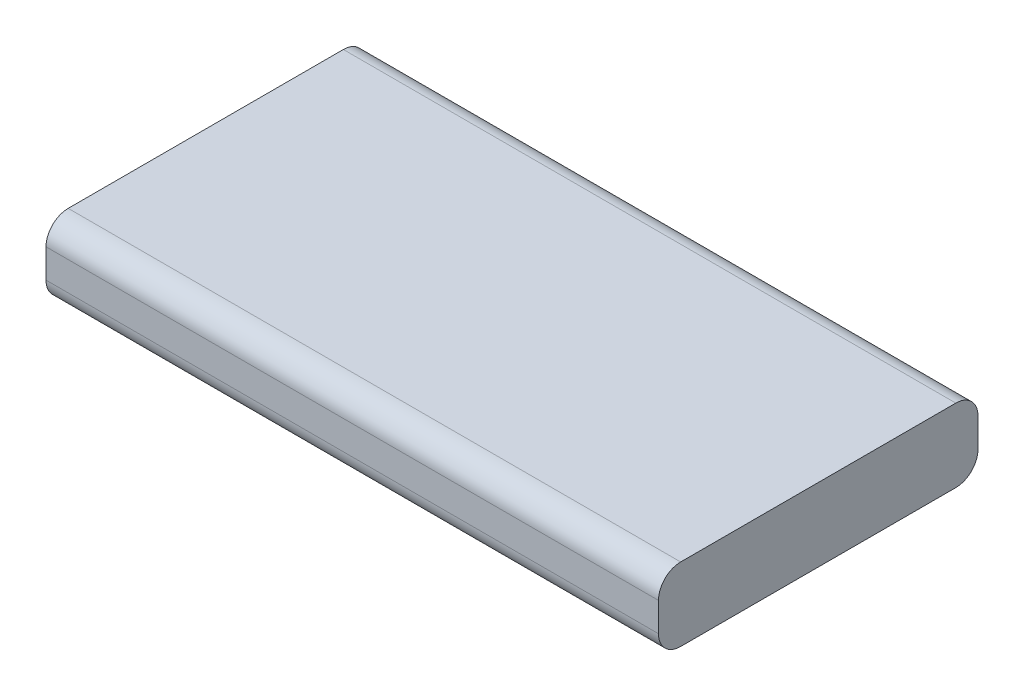
ISO-10303-21;
HEADER;
FILE_DESCRIPTION(('STEP AP214'),'2;1');
FILE_NAME('part.step','',(''),(''),'','','');
FILE_SCHEMA(('AUTOMOTIVE_DESIGN { 1 0 10303 214 1 1 1 1 }'));
ENDSEC;
DATA;
#1=APPLICATION_CONTEXT('core data for automotive mechanical design processes');
#2=APPLICATION_PROTOCOL_DEFINITION('international standard','automotive_design',2000,#1);
#3=PRODUCT_CONTEXT('',#1,'mechanical');
#4=PRODUCT('Part','Part','',(#3));
#5=PRODUCT_RELATED_PRODUCT_CATEGORY('part','',(#4));
#6=PRODUCT_DEFINITION_FORMATION('','',#4);
#7=PRODUCT_DEFINITION_CONTEXT('part definition',#1,'design');
#8=PRODUCT_DEFINITION('design','',#6,#7);
#9=PRODUCT_DEFINITION_SHAPE('','',#8);
#10=(LENGTH_UNIT() NAMED_UNIT(*) SI_UNIT(.MILLI.,.METRE.));
#11=(NAMED_UNIT(*) PLANE_ANGLE_UNIT() SI_UNIT($,.RADIAN.));
#12=(NAMED_UNIT(*) SI_UNIT($,.STERADIAN.) SOLID_ANGLE_UNIT());
#13=UNCERTAINTY_MEASURE_WITH_UNIT(LENGTH_MEASURE(1.E-05),#10,'distance_accuracy_value','');
#14=(GEOMETRIC_REPRESENTATION_CONTEXT(3) GLOBAL_UNCERTAINTY_ASSIGNED_CONTEXT((#13)) GLOBAL_UNIT_ASSIGNED_CONTEXT((#10,
#11,#12)) REPRESENTATION_CONTEXT('',''));
#15=CARTESIAN_POINT('',(0.,0.,0.));
#16=DIRECTION('',(0.,0.,1.));
#17=DIRECTION('',(1.,0.,0.));
#18=AXIS2_PLACEMENT_3D('',#15,#16,#17);
#19=CARTESIAN_POINT('',(13.8,-1.65,-7.2));
#20=DIRECTION('',(1.,0.,0.));
#21=DIRECTION('',(0.,0.,-1.));
#22=AXIS2_PLACEMENT_3D('',#19,#20,#21);
#23=PLANE('',#22);
#24=DIRECTION('',(0.,0.,-1.));
#25=VECTOR('',#24,1.);
#26=CARTESIAN_POINT('',(13.8,-1.65,-7.2));
#27=LINE('',#26,#25);
#28=CARTESIAN_POINT('',(13.8,-1.65,6.2));
#29=VERTEX_POINT('',#28);
#30=CARTESIAN_POINT('',(13.8,-1.65,-6.2));
#31=VERTEX_POINT('',#30);
#32=EDGE_CURVE('E171',#29,#31,#27,.T.);
#33=ORIENTED_EDGE('',*,*,#32,.T.);
#34=CARTESIAN_POINT('',(13.8,-0.65,-6.2));
#35=DIRECTION('',(1.,0.,0.));
#36=DIRECTION('',(0.,0.,-1.));
#37=AXIS2_PLACEMENT_3D('',#34,#35,#36);
#38=CIRCLE('',#37,1.);
#39=CARTESIAN_POINT('',(13.8,-0.65,-7.2));
#40=VERTEX_POINT('',#39);
#41=EDGE_CURVE('E146',#31,#40,#38,.T.);
#42=ORIENTED_EDGE('',*,*,#41,.T.);
#43=DIRECTION('',(0.,1.,0.));
#44=VECTOR('',#43,1.);
#45=CARTESIAN_POINT('',(13.8,-1.65,-7.2));
#46=LINE('',#45,#44);
#47=CARTESIAN_POINT('',(13.8,0.65,-7.2));
#48=VERTEX_POINT('',#47);
#49=EDGE_CURVE('E120',#40,#48,#46,.T.);
#50=ORIENTED_EDGE('',*,*,#49,.T.);
#51=CARTESIAN_POINT('',(13.8,0.65,-6.2));
#52=DIRECTION('',(1.,0.,0.));
#53=DIRECTION('',(0.,0.,-1.));
#54=AXIS2_PLACEMENT_3D('',#51,#52,#53);
#55=CIRCLE('',#54,1.);
#56=CARTESIAN_POINT('',(13.8,1.65,-6.2));
#57=VERTEX_POINT('',#56);
#58=EDGE_CURVE('E144',#48,#57,#55,.T.);
#59=ORIENTED_EDGE('',*,*,#58,.T.);
#60=DIRECTION('',(0.,0.,-1.));
#61=VECTOR('',#60,1.);
#62=CARTESIAN_POINT('',(13.8,1.65,-7.2));
#63=LINE('',#62,#61);
#64=CARTESIAN_POINT('',(13.8,1.65,6.2));
#65=VERTEX_POINT('',#64);
#66=EDGE_CURVE('E165',#65,#57,#63,.T.);
#67=ORIENTED_EDGE('',*,*,#66,.F.);
#68=CARTESIAN_POINT('',(13.8,0.65,6.2));
#69=DIRECTION('',(1.,0.,0.));
#70=DIRECTION('',(0.,0.,-1.));
#71=AXIS2_PLACEMENT_3D('',#68,#69,#70);
#72=CIRCLE('',#71,1.);
#73=CARTESIAN_POINT('',(13.8,0.65,7.2));
#74=VERTEX_POINT('',#73);
#75=EDGE_CURVE('E49',#65,#74,#72,.T.);
#76=ORIENTED_EDGE('',*,*,#75,.T.);
#77=DIRECTION('',(0.,1.,0.));
#78=VECTOR('',#77,1.);
#79=CARTESIAN_POINT('',(13.8,-1.65,7.2));
#80=LINE('',#79,#78);
#81=CARTESIAN_POINT('',(13.8,-0.65,7.2));
#82=VERTEX_POINT('',#81);
#83=EDGE_CURVE('E129',#82,#74,#80,.T.);
#84=ORIENTED_EDGE('',*,*,#83,.F.);
#85=CARTESIAN_POINT('',(13.8,-0.65,6.2));
#86=DIRECTION('',(1.,0.,0.));
#87=DIRECTION('',(0.,0.,-1.));
#88=AXIS2_PLACEMENT_3D('',#85,#86,#87);
#89=CIRCLE('',#88,1.);
#90=EDGE_CURVE('E57',#82,#29,#89,.T.);
#91=ORIENTED_EDGE('',*,*,#90,.T.);
#92=EDGE_LOOP('',(#33,#42,#50,#59,#67,#76,#84,#91));
#93=FACE_BOUND('',#92,.T.);
#94=ADVANCED_FACE('F34',(#93),#23,.T.);
#95=CARTESIAN_POINT('',(-13.8,-1.65,7.2));
#96=DIRECTION('',(0.,0.,1.));
#97=DIRECTION('',(1.,0.,0.));
#98=AXIS2_PLACEMENT_3D('',#95,#96,#97);
#99=PLANE('',#98);
#100=DIRECTION('',(0.,1.,0.));
#101=VECTOR('',#100,1.);
#102=CARTESIAN_POINT('',(-13.8,-1.65,7.2));
#103=LINE('',#102,#101);
#104=CARTESIAN_POINT('',(-13.8,-0.65,7.2));
#105=VERTEX_POINT('',#104);
#106=CARTESIAN_POINT('',(-13.8,0.65,7.2));
#107=VERTEX_POINT('',#106);
#108=EDGE_CURVE('E126',#105,#107,#103,.T.);
#109=ORIENTED_EDGE('',*,*,#108,.F.);
#110=DIRECTION('',(1.,0.,0.));
#111=VECTOR('',#110,1.);
#112=CARTESIAN_POINT('',(13.8,-0.65,7.2));
#113=LINE('',#112,#111);
#114=EDGE_CURVE('E11',#105,#82,#113,.T.);
#115=ORIENTED_EDGE('',*,*,#114,.T.);
#116=ORIENTED_EDGE('',*,*,#83,.T.);
#117=DIRECTION('',(1.,0.,0.));
#118=VECTOR('',#117,1.);
#119=CARTESIAN_POINT('',(-13.8,0.65,7.2));
#120=LINE('',#119,#118);
#121=EDGE_CURVE('E42',#74,#107,#120,.F.);
#122=ORIENTED_EDGE('',*,*,#121,.T.);
#123=EDGE_LOOP('',(#109,#115,#116,#122));
#124=FACE_BOUND('',#123,.T.);
#125=ADVANCED_FACE('F156',(#124),#99,.T.);
#126=CARTESIAN_POINT('',(-13.8,-1.65,-7.2));
#127=DIRECTION('',(-1.,0.,0.));
#128=DIRECTION('',(0.,0.,1.));
#129=AXIS2_PLACEMENT_3D('',#126,#127,#128);
#130=PLANE('',#129);
#131=DIRECTION('',(0.,1.,0.));
#132=VECTOR('',#131,1.);
#133=CARTESIAN_POINT('',(-13.8,-1.65,-7.2));
#134=LINE('',#133,#132);
#135=CARTESIAN_POINT('',(-13.8,-0.65,-7.2));
#136=VERTEX_POINT('',#135);
#137=CARTESIAN_POINT('',(-13.8,0.65,-7.2));
#138=VERTEX_POINT('',#137);
#139=EDGE_CURVE('E117',#136,#138,#134,.T.);
#140=ORIENTED_EDGE('',*,*,#139,.F.);
#141=CARTESIAN_POINT('',(-13.8,-0.65,-6.2));
#142=DIRECTION('',(-1.,0.,0.));
#143=DIRECTION('',(0.,0.,1.));
#144=AXIS2_PLACEMENT_3D('',#141,#142,#143);
#145=CIRCLE('',#144,1.);
#146=CARTESIAN_POINT('',(-13.8,-1.65,-6.2));
#147=VERTEX_POINT('',#146);
#148=EDGE_CURVE('E100',#136,#147,#145,.T.);
#149=ORIENTED_EDGE('',*,*,#148,.T.);
#150=DIRECTION('',(0.,0.,1.));
#151=VECTOR('',#150,1.);
#152=CARTESIAN_POINT('',(-13.8,-1.65,-7.2));
#153=LINE('',#152,#151);
#154=CARTESIAN_POINT('',(-13.8,-1.65,6.2));
#155=VERTEX_POINT('',#154);
#156=EDGE_CURVE('E131',#147,#155,#153,.T.);
#157=ORIENTED_EDGE('',*,*,#156,.T.);
#158=CARTESIAN_POINT('',(-13.8,-0.65,6.2));
#159=DIRECTION('',(-1.,0.,0.));
#160=DIRECTION('',(0.,0.,1.));
#161=AXIS2_PLACEMENT_3D('',#158,#159,#160);
#162=CIRCLE('',#161,1.);
#163=EDGE_CURVE('E137',#155,#105,#162,.T.);
#164=ORIENTED_EDGE('',*,*,#163,.T.);
#165=ORIENTED_EDGE('',*,*,#108,.T.);
#166=CARTESIAN_POINT('',(-13.8,0.65,6.2));
#167=DIRECTION('',(-1.,0.,0.));
#168=DIRECTION('',(0.,0.,1.));
#169=AXIS2_PLACEMENT_3D('',#166,#167,#168);
#170=CIRCLE('',#169,1.);
#171=CARTESIAN_POINT('',(-13.8,1.65,6.2));
#172=VERTEX_POINT('',#171);
#173=EDGE_CURVE('E121',#107,#172,#170,.T.);
#174=ORIENTED_EDGE('',*,*,#173,.T.);
#175=DIRECTION('',(0.,0.,1.));
#176=VECTOR('',#175,1.);
#177=CARTESIAN_POINT('',(-13.8,1.65,-7.2));
#178=LINE('',#177,#176);
#179=CARTESIAN_POINT('',(-13.8,1.65,-6.2));
#180=VERTEX_POINT('',#179);
#181=EDGE_CURVE('E167',#180,#172,#178,.T.);
#182=ORIENTED_EDGE('',*,*,#181,.F.);
#183=CARTESIAN_POINT('',(-13.8,0.65,-6.2));
#184=DIRECTION('',(-1.,0.,0.));
#185=DIRECTION('',(0.,0.,1.));
#186=AXIS2_PLACEMENT_3D('',#183,#184,#185);
#187=CIRCLE('',#186,1.);
#188=EDGE_CURVE('E111',#180,#138,#187,.T.);
#189=ORIENTED_EDGE('',*,*,#188,.T.);
#190=EDGE_LOOP('',(#140,#149,#157,#164,#165,#174,#182,#189));
#191=FACE_BOUND('',#190,.T.);
#192=ADVANCED_FACE('F124',(#191),#130,.T.);
#193=CARTESIAN_POINT('',(-13.8,-1.65,-7.2));
#194=DIRECTION('',(0.,0.,-1.));
#195=DIRECTION('',(-1.,0.,0.));
#196=AXIS2_PLACEMENT_3D('',#193,#194,#195);
#197=PLANE('',#196);
#198=ORIENTED_EDGE('',*,*,#49,.F.);
#199=DIRECTION('',(-1.,0.,0.));
#200=VECTOR('',#199,1.);
#201=CARTESIAN_POINT('',(-13.8,-0.65,-7.2));
#202=LINE('',#201,#200);
#203=EDGE_CURVE('E104',#40,#136,#202,.T.);
#204=ORIENTED_EDGE('',*,*,#203,.T.);
#205=ORIENTED_EDGE('',*,*,#139,.T.);
#206=DIRECTION('',(-1.,0.,0.));
#207=VECTOR('',#206,1.);
#208=CARTESIAN_POINT('',(-13.8,0.65,-7.2));
#209=LINE('',#208,#207);
#210=EDGE_CURVE('E122',#138,#48,#209,.F.);
#211=ORIENTED_EDGE('',*,*,#210,.T.);
#212=EDGE_LOOP('',(#198,#204,#205,#211));
#213=FACE_BOUND('',#212,.T.);
#214=ADVANCED_FACE('F116',(#213),#197,.T.);
#215=CARTESIAN_POINT('',(0.,-1.65,0.));
#216=DIRECTION('',(0.,1.,0.));
#217=DIRECTION('',(0.,0.,1.));
#218=AXIS2_PLACEMENT_3D('',#215,#216,#217);
#219=PLANE('',#218);
#220=ORIENTED_EDGE('',*,*,#156,.F.);
#221=DIRECTION('',(-1.,0.,0.));
#222=VECTOR('',#221,1.);
#223=CARTESIAN_POINT('',(13.8,-1.65,-6.2));
#224=LINE('',#223,#222);
#225=EDGE_CURVE('E105',#147,#31,#224,.F.);
#226=ORIENTED_EDGE('',*,*,#225,.T.);
#227=ORIENTED_EDGE('',*,*,#32,.F.);
#228=DIRECTION('',(1.,0.,0.));
#229=VECTOR('',#228,1.);
#230=CARTESIAN_POINT('',(-13.8,-1.65,6.2));
#231=LINE('',#230,#229);
#232=EDGE_CURVE('E110',#29,#155,#231,.F.);
#233=ORIENTED_EDGE('',*,*,#232,.T.);
#234=EDGE_LOOP('',(#220,#226,#227,#233));
#235=FACE_BOUND('',#234,.T.);
#236=ADVANCED_FACE('F178',(#235),#219,.F.);
#237=CARTESIAN_POINT('',(0.,1.65,0.));
#238=DIRECTION('',(0.,1.,0.));
#239=DIRECTION('',(0.,0.,1.));
#240=AXIS2_PLACEMENT_3D('',#237,#238,#239);
#241=PLANE('',#240);
#242=ORIENTED_EDGE('',*,*,#66,.T.);
#243=DIRECTION('',(-1.,0.,0.));
#244=VECTOR('',#243,1.);
#245=CARTESIAN_POINT('',(0.,1.65,-6.2));
#246=LINE('',#245,#244);
#247=EDGE_CURVE('E151',#57,#180,#246,.T.);
#248=ORIENTED_EDGE('',*,*,#247,.T.);
#249=ORIENTED_EDGE('',*,*,#181,.T.);
#250=DIRECTION('',(1.,0.,0.));
#251=VECTOR('',#250,1.);
#252=CARTESIAN_POINT('',(0.,1.65,6.2));
#253=LINE('',#252,#251);
#254=EDGE_CURVE('E148',#172,#65,#253,.T.);
#255=ORIENTED_EDGE('',*,*,#254,.T.);
#256=EDGE_LOOP('',(#242,#248,#249,#255));
#257=FACE_BOUND('',#256,.T.);
#258=ADVANCED_FACE('F164',(#257),#241,.T.);
#259=CARTESIAN_POINT('',(-13.8,-0.65,-6.2));
#260=DIRECTION('',(1.,0.,0.));
#261=DIRECTION('',(0.,0.,-1.));
#262=AXIS2_PLACEMENT_3D('',#259,#260,#261);
#263=CYLINDRICAL_SURFACE('',#262,1.);
#264=ORIENTED_EDGE('',*,*,#41,.F.);
#265=ORIENTED_EDGE('',*,*,#225,.F.);
#266=ORIENTED_EDGE('',*,*,#148,.F.);
#267=ORIENTED_EDGE('',*,*,#203,.F.);
#268=EDGE_LOOP('',(#264,#265,#266,#267));
#269=FACE_BOUND('',#268,.T.);
#270=ADVANCED_FACE('F103',(#269),#263,.T.);
#271=CARTESIAN_POINT('',(0.,0.65,-6.2));
#272=DIRECTION('',(-1.,0.,0.));
#273=DIRECTION('',(0.,0.,1.));
#274=AXIS2_PLACEMENT_3D('',#271,#272,#273);
#275=CYLINDRICAL_SURFACE('',#274,1.);
#276=ORIENTED_EDGE('',*,*,#58,.F.);
#277=ORIENTED_EDGE('',*,*,#210,.F.);
#278=ORIENTED_EDGE('',*,*,#188,.F.);
#279=ORIENTED_EDGE('',*,*,#247,.F.);
#280=EDGE_LOOP('',(#276,#277,#278,#279));
#281=FACE_BOUND('',#280,.T.);
#282=ADVANCED_FACE('F197',(#281),#275,.T.);
#283=CARTESIAN_POINT('',(-13.8,-0.65,6.2));
#284=DIRECTION('',(-1.,0.,0.));
#285=DIRECTION('',(0.,0.,1.));
#286=AXIS2_PLACEMENT_3D('',#283,#284,#285);
#287=CYLINDRICAL_SURFACE('',#286,1.);
#288=ORIENTED_EDGE('',*,*,#163,.F.);
#289=ORIENTED_EDGE('',*,*,#232,.F.);
#290=ORIENTED_EDGE('',*,*,#90,.F.);
#291=ORIENTED_EDGE('',*,*,#114,.F.);
#292=EDGE_LOOP('',(#288,#289,#290,#291));
#293=FACE_BOUND('',#292,.T.);
#294=ADVANCED_FACE('F176',(#293),#287,.T.);
#295=CARTESIAN_POINT('',(0.,0.65,6.2));
#296=DIRECTION('',(1.,0.,0.));
#297=DIRECTION('',(0.,0.,-1.));
#298=AXIS2_PLACEMENT_3D('',#295,#296,#297);
#299=CYLINDRICAL_SURFACE('',#298,1.);
#300=ORIENTED_EDGE('',*,*,#173,.F.);
#301=ORIENTED_EDGE('',*,*,#121,.F.);
#302=ORIENTED_EDGE('',*,*,#75,.F.);
#303=ORIENTED_EDGE('',*,*,#254,.F.);
#304=EDGE_LOOP('',(#300,#301,#302,#303));
#305=FACE_BOUND('',#304,.T.);
#306=ADVANCED_FACE('F36',(#305),#299,.T.);
#307=CLOSED_SHELL('',(#94,#125,#192,#214,#236,#258,#270,#282,#294,#306));
#308=MANIFOLD_SOLID_BREP('B2',#307);
#309=ADVANCED_BREP_SHAPE_REPRESENTATION('',(#18,#308),#14);
#310=SHAPE_DEFINITION_REPRESENTATION(#9,#309);
ENDSEC;
END-ISO-10303-21;
